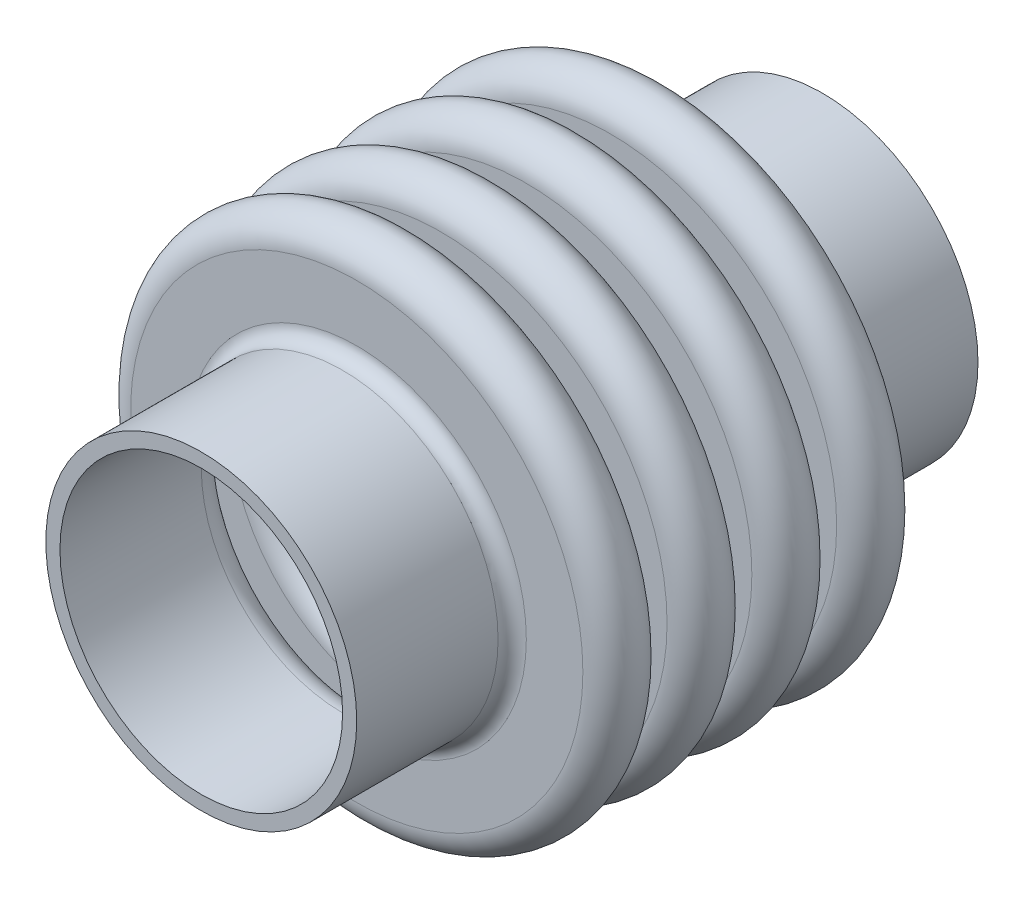
ISO-10303-21;
HEADER;
FILE_DESCRIPTION(('STEP AP214'),'2;1');
FILE_NAME('part.step','',(''),(''),'','','');
FILE_SCHEMA(('AUTOMOTIVE_DESIGN { 1 0 10303 214 1 1 1 1 }'));
ENDSEC;
DATA;
#1=APPLICATION_CONTEXT('core data for automotive mechanical design processes');
#2=APPLICATION_PROTOCOL_DEFINITION('international standard','automotive_design',2000,#1);
#3=PRODUCT_CONTEXT('',#1,'mechanical');
#4=PRODUCT('Part','Part','',(#3));
#5=PRODUCT_RELATED_PRODUCT_CATEGORY('part','',(#4));
#6=PRODUCT_DEFINITION_FORMATION('','',#4);
#7=PRODUCT_DEFINITION_CONTEXT('part definition',#1,'design');
#8=PRODUCT_DEFINITION('design','',#6,#7);
#9=PRODUCT_DEFINITION_SHAPE('','',#8);
#10=(LENGTH_UNIT() NAMED_UNIT(*) SI_UNIT(.MILLI.,.METRE.));
#11=(NAMED_UNIT(*) PLANE_ANGLE_UNIT() SI_UNIT($,.RADIAN.));
#12=(NAMED_UNIT(*) SI_UNIT($,.STERADIAN.) SOLID_ANGLE_UNIT());
#13=UNCERTAINTY_MEASURE_WITH_UNIT(LENGTH_MEASURE(1.E-05),#10,'distance_accuracy_value','');
#14=(GEOMETRIC_REPRESENTATION_CONTEXT(3) GLOBAL_UNCERTAINTY_ASSIGNED_CONTEXT((#13)) GLOBAL_UNIT_ASSIGNED_CONTEXT((#10,
#11,#12)) REPRESENTATION_CONTEXT('',''));
#15=CARTESIAN_POINT('',(0.,0.,0.));
#16=DIRECTION('',(0.,0.,1.));
#17=DIRECTION('',(1.,0.,0.));
#18=AXIS2_PLACEMENT_3D('',#15,#16,#17);
#19=CARTESIAN_POINT('',(0.,27.94,43.18));
#20=DIRECTION('',(0.,0.,-1.));
#21=DIRECTION('',(-1.,0.,0.));
#22=AXIS2_PLACEMENT_3D('',#19,#20,#21);
#23=PLANE('',#22);
#24=CARTESIAN_POINT('',(0.,0.,43.18));
#25=DIRECTION('',(0.,0.,1.));
#26=DIRECTION('',(1.,0.,0.));
#27=AXIS2_PLACEMENT_3D('',#24,#25,#26);
#28=CIRCLE('',#27,25.4);
#29=CARTESIAN_POINT('',(25.4,0.,43.18));
#30=VERTEX_POINT('',#29);
#31=EDGE_CURVE('E10',#30,#30,#28,.T.);
#32=ORIENTED_EDGE('',*,*,#31,.F.);
#33=EDGE_LOOP('',(#32));
#34=FACE_BOUND('',#33,.T.);
#35=CARTESIAN_POINT('',(0.,0.,43.18));
#36=DIRECTION('',(0.,0.,1.));
#37=DIRECTION('',(1.,0.,0.));
#38=AXIS2_PLACEMENT_3D('',#35,#36,#37);
#39=CIRCLE('',#38,27.94);
#40=CARTESIAN_POINT('',(27.94,0.,43.18));
#41=VERTEX_POINT('',#40);
#42=EDGE_CURVE('E156',#41,#41,#39,.T.);
#43=ORIENTED_EDGE('',*,*,#42,.T.);
#44=EDGE_LOOP('',(#43));
#45=FACE_BOUND('',#44,.T.);
#46=ADVANCED_FACE('F32',(#34,#45),#23,.F.);
#47=CARTESIAN_POINT('',(0.,0.,39.0149144384826));
#48=DIRECTION('',(0.,0.,1.));
#49=DIRECTION('',(1.,0.,0.));
#50=AXIS2_PLACEMENT_3D('',#47,#48,#49);
#51=CYLINDRICAL_SURFACE('',#50,25.4);
#52=CARTESIAN_POINT('',(0.,0.,17.78));
#53=DIRECTION('',(0.,0.,1.));
#54=DIRECTION('',(1.,0.,0.));
#55=AXIS2_PLACEMENT_3D('',#52,#53,#54);
#56=CIRCLE('',#55,25.4);
#57=CARTESIAN_POINT('',(25.4,0.,17.78));
#58=VERTEX_POINT('',#57);
#59=EDGE_CURVE('E38',#58,#58,#56,.T.);
#60=ORIENTED_EDGE('',*,*,#59,.F.);
#61=EDGE_LOOP('',(#60));
#62=FACE_BOUND('',#61,.T.);
#63=ORIENTED_EDGE('',*,*,#31,.T.);
#64=EDGE_LOOP('',(#63));
#65=FACE_BOUND('',#64,.T.);
#66=ADVANCED_FACE('F385',(#62,#65),#51,.F.);
#67=CARTESIAN_POINT('',(0.,0.,17.78));
#68=DIRECTION('',(0.,0.,1.));
#69=DIRECTION('',(1.,0.,0.));
#70=AXIS2_PLACEMENT_3D('',#67,#68,#69);
#71=TOROIDAL_SURFACE('',#70,30.48,5.08);
#72=CARTESIAN_POINT('',(0.,0.,12.7));
#73=DIRECTION('',(0.,0.,1.));
#74=DIRECTION('',(1.,0.,0.));
#75=AXIS2_PLACEMENT_3D('',#72,#73,#74);
#76=CIRCLE('',#75,30.48);
#77=CARTESIAN_POINT('',(30.48,0.,12.7));
#78=VERTEX_POINT('',#77);
#79=EDGE_CURVE('E42',#78,#78,#76,.T.);
#80=ORIENTED_EDGE('',*,*,#79,.F.);
#81=EDGE_LOOP('',(#80));
#82=FACE_BOUND('',#81,.T.);
#83=ORIENTED_EDGE('',*,*,#59,.T.);
#84=EDGE_LOOP('',(#83));
#85=FACE_BOUND('',#84,.T.);
#86=ADVANCED_FACE('F380',(#82,#85),#71,.T.);
#87=CARTESIAN_POINT('',(0.,30.48,12.7));
#88=DIRECTION('',(0.,0.,1.));
#89=DIRECTION('',(1.,0.,0.));
#90=AXIS2_PLACEMENT_3D('',#87,#88,#89);
#91=PLANE('',#90);
#92=CARTESIAN_POINT('',(0.,0.,12.7));
#93=DIRECTION('',(0.,0.,1.));
#94=DIRECTION('',(1.,0.,0.));
#95=AXIS2_PLACEMENT_3D('',#92,#93,#94);
#96=CIRCLE('',#95,40.64);
#97=CARTESIAN_POINT('',(40.64,0.,12.7));
#98=VERTEX_POINT('',#97);
#99=EDGE_CURVE('E46',#98,#98,#96,.T.);
#100=ORIENTED_EDGE('',*,*,#99,.F.);
#101=EDGE_LOOP('',(#100));
#102=FACE_BOUND('',#101,.T.);
#103=ORIENTED_EDGE('',*,*,#79,.T.);
#104=EDGE_LOOP('',(#103));
#105=FACE_BOUND('',#104,.T.);
#106=ADVANCED_FACE('F374',(#102,#105),#91,.F.);
#107=CARTESIAN_POINT('',(0.,0.,10.16));
#108=DIRECTION('',(0.,0.,1.));
#109=DIRECTION('',(1.,0.,0.));
#110=AXIS2_PLACEMENT_3D('',#107,#108,#109);
#111=TOROIDAL_SURFACE('',#110,40.64,2.54);
#112=CARTESIAN_POINT('',(0.,0.,7.61999999999999));
#113=DIRECTION('',(0.,0.,1.));
#114=DIRECTION('',(1.,0.,0.));
#115=AXIS2_PLACEMENT_3D('',#112,#113,#114);
#116=CIRCLE('',#115,40.64);
#117=CARTESIAN_POINT('',(40.64,0.,7.61999999999999));
#118=VERTEX_POINT('',#117);
#119=EDGE_CURVE('E51',#118,#118,#116,.T.);
#120=ORIENTED_EDGE('',*,*,#119,.F.);
#121=EDGE_LOOP('',(#120));
#122=FACE_BOUND('',#121,.T.);
#123=ORIENTED_EDGE('',*,*,#99,.T.);
#124=EDGE_LOOP('',(#123));
#125=FACE_BOUND('',#124,.T.);
#126=ADVANCED_FACE('F368',(#122,#125),#111,.F.);
#127=CARTESIAN_POINT('',(0.,40.64,7.61999999999999));
#128=DIRECTION('',(0.,0.,-1.));
#129=DIRECTION('',(-1.,0.,0.));
#130=AXIS2_PLACEMENT_3D('',#127,#128,#129);
#131=PLANE('',#130);
#132=CARTESIAN_POINT('',(0.,0.,7.61999999999999));
#133=DIRECTION('',(0.,0.,1.));
#134=DIRECTION('',(1.,0.,0.));
#135=AXIS2_PLACEMENT_3D('',#132,#133,#134);
#136=CIRCLE('',#135,30.48);
#137=CARTESIAN_POINT('',(30.48,0.,7.61999999999999));
#138=VERTEX_POINT('',#137);
#139=EDGE_CURVE('E54',#138,#138,#136,.T.);
#140=ORIENTED_EDGE('',*,*,#139,.F.);
#141=EDGE_LOOP('',(#140));
#142=FACE_BOUND('',#141,.T.);
#143=ORIENTED_EDGE('',*,*,#119,.T.);
#144=EDGE_LOOP('',(#143));
#145=FACE_BOUND('',#144,.T.);
#146=ADVANCED_FACE('F362',(#142,#145),#131,.F.);
#147=CARTESIAN_POINT('',(0.,0.,2.59448822453713));
#148=DIRECTION('',(0.,0.,1.));
#149=DIRECTION('',(1.,0.,0.));
#150=AXIS2_PLACEMENT_3D('',#147,#148,#149);
#151=TOROIDAL_SURFACE('',#150,30.48,5.02551177546286);
#152=CARTESIAN_POINT('',(0.,0.,-2.43102355092573));
#153=DIRECTION('',(0.,0.,1.));
#154=DIRECTION('',(1.,0.,0.));
#155=AXIS2_PLACEMENT_3D('',#152,#153,#154);
#156=CIRCLE('',#155,30.48);
#157=CARTESIAN_POINT('',(30.48,0.,-2.43102355092573));
#158=VERTEX_POINT('',#157);
#159=EDGE_CURVE('E57',#158,#158,#156,.T.);
#160=ORIENTED_EDGE('',*,*,#159,.F.);
#161=EDGE_LOOP('',(#160));
#162=FACE_BOUND('',#161,.T.);
#163=ORIENTED_EDGE('',*,*,#139,.T.);
#164=EDGE_LOOP('',(#163));
#165=FACE_BOUND('',#164,.T.);
#166=ADVANCED_FACE('F356',(#162,#165),#151,.T.);
#167=CARTESIAN_POINT('',(0.,30.48,-2.43102355092573));
#168=DIRECTION('',(0.,0.,1.));
#169=DIRECTION('',(1.,0.,0.));
#170=AXIS2_PLACEMENT_3D('',#167,#168,#169);
#171=PLANE('',#170);
#172=CARTESIAN_POINT('',(0.,0.,-2.43102355092573));
#173=DIRECTION('',(0.,0.,1.));
#174=DIRECTION('',(1.,0.,0.));
#175=AXIS2_PLACEMENT_3D('',#172,#173,#174);
#176=CIRCLE('',#175,40.64);
#177=CARTESIAN_POINT('',(40.64,0.,-2.43102355092573));
#178=VERTEX_POINT('',#177);
#179=EDGE_CURVE('E60',#178,#178,#176,.T.);
#180=ORIENTED_EDGE('',*,*,#179,.F.);
#181=EDGE_LOOP('',(#180));
#182=FACE_BOUND('',#181,.T.);
#183=ORIENTED_EDGE('',*,*,#159,.T.);
#184=EDGE_LOOP('',(#183));
#185=FACE_BOUND('',#184,.T.);
#186=ADVANCED_FACE('F350',(#182,#185),#171,.F.);
#187=CARTESIAN_POINT('',(0.,0.,-4.97102355092573));
#188=DIRECTION('',(0.,0.,1.));
#189=DIRECTION('',(1.,0.,0.));
#190=AXIS2_PLACEMENT_3D('',#187,#188,#189);
#191=TOROIDAL_SURFACE('',#190,40.64,2.54);
#192=CARTESIAN_POINT('',(0.,0.,-7.51102355092573));
#193=DIRECTION('',(0.,0.,1.));
#194=DIRECTION('',(1.,0.,0.));
#195=AXIS2_PLACEMENT_3D('',#192,#193,#194);
#196=CIRCLE('',#195,40.64);
#197=CARTESIAN_POINT('',(40.64,0.,-7.51102355092573));
#198=VERTEX_POINT('',#197);
#199=EDGE_CURVE('E63',#198,#198,#196,.T.);
#200=ORIENTED_EDGE('',*,*,#199,.F.);
#201=EDGE_LOOP('',(#200));
#202=FACE_BOUND('',#201,.T.);
#203=ORIENTED_EDGE('',*,*,#179,.T.);
#204=EDGE_LOOP('',(#203));
#205=FACE_BOUND('',#204,.T.);
#206=ADVANCED_FACE('F344',(#202,#205),#191,.F.);
#207=CARTESIAN_POINT('',(0.,40.64,-7.51102355092573));
#208=DIRECTION('',(0.,0.,-1.));
#209=DIRECTION('',(-1.,0.,0.));
#210=AXIS2_PLACEMENT_3D('',#207,#208,#209);
#211=PLANE('',#210);
#212=CARTESIAN_POINT('',(0.,0.,-7.51102355092573));
#213=DIRECTION('',(0.,0.,1.));
#214=DIRECTION('',(1.,0.,0.));
#215=AXIS2_PLACEMENT_3D('',#212,#213,#214);
#216=CIRCLE('',#215,30.48);
#217=CARTESIAN_POINT('',(30.48,0.,-7.51102355092573));
#218=VERTEX_POINT('',#217);
#219=EDGE_CURVE('E66',#218,#218,#216,.T.);
#220=ORIENTED_EDGE('',*,*,#219,.F.);
#221=EDGE_LOOP('',(#220));
#222=FACE_BOUND('',#221,.T.);
#223=ORIENTED_EDGE('',*,*,#199,.T.);
#224=EDGE_LOOP('',(#223));
#225=FACE_BOUND('',#224,.T.);
#226=ADVANCED_FACE('F338',(#222,#225),#211,.F.);
#227=CARTESIAN_POINT('',(0.,0.,-12.5910235509257));
#228=DIRECTION('',(0.,0.,1.));
#229=DIRECTION('',(1.,0.,0.));
#230=AXIS2_PLACEMENT_3D('',#227,#228,#229);
#231=TOROIDAL_SURFACE('',#230,30.48,5.08);
#232=CARTESIAN_POINT('',(0.,0.,-17.6710235509257));
#233=DIRECTION('',(0.,0.,1.));
#234=DIRECTION('',(1.,0.,0.));
#235=AXIS2_PLACEMENT_3D('',#232,#233,#234);
#236=CIRCLE('',#235,30.48);
#237=CARTESIAN_POINT('',(30.48,0.,-17.6710235509257));
#238=VERTEX_POINT('',#237);
#239=EDGE_CURVE('E69',#238,#238,#236,.T.);
#240=ORIENTED_EDGE('',*,*,#239,.F.);
#241=EDGE_LOOP('',(#240));
#242=FACE_BOUND('',#241,.T.);
#243=ORIENTED_EDGE('',*,*,#219,.T.);
#244=EDGE_LOOP('',(#243));
#245=FACE_BOUND('',#244,.T.);
#246=ADVANCED_FACE('F332',(#242,#245),#231,.T.);
#247=CARTESIAN_POINT('',(0.,30.48,-17.6710235509257));
#248=DIRECTION('',(0.,0.,1.));
#249=DIRECTION('',(1.,0.,0.));
#250=AXIS2_PLACEMENT_3D('',#247,#248,#249);
#251=PLANE('',#250);
#252=CARTESIAN_POINT('',(0.,0.,-17.6710235509257));
#253=DIRECTION('',(0.,0.,1.));
#254=DIRECTION('',(1.,0.,0.));
#255=AXIS2_PLACEMENT_3D('',#252,#253,#254);
#256=CIRCLE('',#255,40.64);
#257=CARTESIAN_POINT('',(40.64,0.,-17.6710235509257));
#258=VERTEX_POINT('',#257);
#259=EDGE_CURVE('E72',#258,#258,#256,.T.);
#260=ORIENTED_EDGE('',*,*,#259,.F.);
#261=EDGE_LOOP('',(#260));
#262=FACE_BOUND('',#261,.T.);
#263=ORIENTED_EDGE('',*,*,#239,.T.);
#264=EDGE_LOOP('',(#263));
#265=FACE_BOUND('',#264,.T.);
#266=ADVANCED_FACE('F326',(#262,#265),#251,.F.);
#267=CARTESIAN_POINT('',(0.,0.,-20.2110235509257));
#268=DIRECTION('',(0.,0.,1.));
#269=DIRECTION('',(1.,0.,0.));
#270=AXIS2_PLACEMENT_3D('',#267,#268,#269);
#271=TOROIDAL_SURFACE('',#270,40.64,2.54);
#272=CARTESIAN_POINT('',(0.,0.,-22.7510235509257));
#273=DIRECTION('',(0.,0.,1.));
#274=DIRECTION('',(1.,0.,0.));
#275=AXIS2_PLACEMENT_3D('',#272,#273,#274);
#276=CIRCLE('',#275,40.64);
#277=CARTESIAN_POINT('',(40.64,0.,-22.7510235509257));
#278=VERTEX_POINT('',#277);
#279=EDGE_CURVE('E75',#278,#278,#276,.T.);
#280=ORIENTED_EDGE('',*,*,#279,.F.);
#281=EDGE_LOOP('',(#280));
#282=FACE_BOUND('',#281,.T.);
#283=ORIENTED_EDGE('',*,*,#259,.T.);
#284=EDGE_LOOP('',(#283));
#285=FACE_BOUND('',#284,.T.);
#286=ADVANCED_FACE('F320',(#282,#285),#271,.F.);
#287=CARTESIAN_POINT('',(0.,40.64,-22.7510235509257));
#288=DIRECTION('',(0.,0.,-1.));
#289=DIRECTION('',(-1.,0.,0.));
#290=AXIS2_PLACEMENT_3D('',#287,#288,#289);
#291=PLANE('',#290);
#292=CARTESIAN_POINT('',(0.,0.,-22.7510235509257));
#293=DIRECTION('',(0.,0.,1.));
#294=DIRECTION('',(1.,0.,0.));
#295=AXIS2_PLACEMENT_3D('',#292,#293,#294);
#296=CIRCLE('',#295,30.48);
#297=CARTESIAN_POINT('',(30.48,0.,-22.7510235509257));
#298=VERTEX_POINT('',#297);
#299=EDGE_CURVE('E78',#298,#298,#296,.T.);
#300=ORIENTED_EDGE('',*,*,#299,.F.);
#301=EDGE_LOOP('',(#300));
#302=FACE_BOUND('',#301,.T.);
#303=ORIENTED_EDGE('',*,*,#279,.T.);
#304=EDGE_LOOP('',(#303));
#305=FACE_BOUND('',#304,.T.);
#306=ADVANCED_FACE('F314',(#302,#305),#291,.F.);
#307=CARTESIAN_POINT('',(0.,0.,-27.8310235509257));
#308=DIRECTION('',(0.,0.,1.));
#309=DIRECTION('',(1.,0.,0.));
#310=AXIS2_PLACEMENT_3D('',#307,#308,#309);
#311=TOROIDAL_SURFACE('',#310,30.48,5.08);
#312=CARTESIAN_POINT('',(0.,0.,-32.9110235509257));
#313=DIRECTION('',(0.,0.,1.));
#314=DIRECTION('',(1.,0.,0.));
#315=AXIS2_PLACEMENT_3D('',#312,#313,#314);
#316=CIRCLE('',#315,30.48);
#317=CARTESIAN_POINT('',(30.48,0.,-32.9110235509257));
#318=VERTEX_POINT('',#317);
#319=EDGE_CURVE('E81',#318,#318,#316,.T.);
#320=ORIENTED_EDGE('',*,*,#319,.F.);
#321=EDGE_LOOP('',(#320));
#322=FACE_BOUND('',#321,.T.);
#323=ORIENTED_EDGE('',*,*,#299,.T.);
#324=EDGE_LOOP('',(#323));
#325=FACE_BOUND('',#324,.T.);
#326=ADVANCED_FACE('F308',(#322,#325),#311,.T.);
#327=CARTESIAN_POINT('',(0.,30.48,-32.9110235509257));
#328=DIRECTION('',(0.,0.,1.));
#329=DIRECTION('',(1.,0.,0.));
#330=AXIS2_PLACEMENT_3D('',#327,#328,#329);
#331=PLANE('',#330);
#332=CARTESIAN_POINT('',(0.,0.,-32.9110235509257));
#333=DIRECTION('',(0.,0.,1.));
#334=DIRECTION('',(1.,0.,0.));
#335=AXIS2_PLACEMENT_3D('',#332,#333,#334);
#336=CIRCLE('',#335,40.64);
#337=CARTESIAN_POINT('',(40.64,0.,-32.9110235509257));
#338=VERTEX_POINT('',#337);
#339=EDGE_CURVE('E84',#338,#338,#336,.T.);
#340=ORIENTED_EDGE('',*,*,#339,.F.);
#341=EDGE_LOOP('',(#340));
#342=FACE_BOUND('',#341,.T.);
#343=ORIENTED_EDGE('',*,*,#319,.T.);
#344=EDGE_LOOP('',(#343));
#345=FACE_BOUND('',#344,.T.);
#346=ADVANCED_FACE('F302',(#342,#345),#331,.F.);
#347=CARTESIAN_POINT('',(0.,0.,-35.4510235509257));
#348=DIRECTION('',(0.,0.,1.));
#349=DIRECTION('',(1.,0.,0.));
#350=AXIS2_PLACEMENT_3D('',#347,#348,#349);
#351=TOROIDAL_SURFACE('',#350,40.64,2.54);
#352=CARTESIAN_POINT('',(0.,0.,-37.9910235509257));
#353=DIRECTION('',(0.,0.,1.));
#354=DIRECTION('',(1.,0.,0.));
#355=AXIS2_PLACEMENT_3D('',#352,#353,#354);
#356=CIRCLE('',#355,40.64);
#357=CARTESIAN_POINT('',(40.64,0.,-37.9910235509257));
#358=VERTEX_POINT('',#357);
#359=EDGE_CURVE('E87',#358,#358,#356,.T.);
#360=ORIENTED_EDGE('',*,*,#359,.F.);
#361=EDGE_LOOP('',(#360));
#362=FACE_BOUND('',#361,.T.);
#363=ORIENTED_EDGE('',*,*,#339,.T.);
#364=EDGE_LOOP('',(#363));
#365=FACE_BOUND('',#364,.T.);
#366=ADVANCED_FACE('F296',(#362,#365),#351,.F.);
#367=CARTESIAN_POINT('',(0.,40.64,-37.9910235509257));
#368=DIRECTION('',(0.,0.,-1.));
#369=DIRECTION('',(-1.,0.,0.));
#370=AXIS2_PLACEMENT_3D('',#367,#368,#369);
#371=PLANE('',#370);
#372=CARTESIAN_POINT('',(0.,0.,-37.9910235509257));
#373=DIRECTION('',(0.,0.,1.));
#374=DIRECTION('',(1.,0.,0.));
#375=AXIS2_PLACEMENT_3D('',#372,#373,#374);
#376=CIRCLE('',#375,30.48);
#377=CARTESIAN_POINT('',(30.48,0.,-37.9910235509257));
#378=VERTEX_POINT('',#377);
#379=EDGE_CURVE('E90',#378,#378,#376,.T.);
#380=ORIENTED_EDGE('',*,*,#379,.F.);
#381=EDGE_LOOP('',(#380));
#382=FACE_BOUND('',#381,.T.);
#383=ORIENTED_EDGE('',*,*,#359,.T.);
#384=EDGE_LOOP('',(#383));
#385=FACE_BOUND('',#384,.T.);
#386=ADVANCED_FACE('F290',(#382,#385),#371,.F.);
#387=CARTESIAN_POINT('',(0.,0.,-43.0710235509257));
#388=DIRECTION('',(0.,0.,1.));
#389=DIRECTION('',(1.,0.,0.));
#390=AXIS2_PLACEMENT_3D('',#387,#388,#389);
#391=TOROIDAL_SURFACE('',#390,30.48,5.08);
#392=CARTESIAN_POINT('',(0.,0.,-43.0710235509258));
#393=DIRECTION('',(0.,0.,1.));
#394=DIRECTION('',(1.,0.,0.));
#395=AXIS2_PLACEMENT_3D('',#392,#393,#394);
#396=CIRCLE('',#395,25.4);
#397=CARTESIAN_POINT('',(25.4,0.,-43.0710235509258));
#398=VERTEX_POINT('',#397);
#399=EDGE_CURVE('E93',#398,#398,#396,.T.);
#400=ORIENTED_EDGE('',*,*,#399,.F.);
#401=EDGE_LOOP('',(#400));
#402=FACE_BOUND('',#401,.T.);
#403=ORIENTED_EDGE('',*,*,#379,.T.);
#404=EDGE_LOOP('',(#403));
#405=FACE_BOUND('',#404,.T.);
#406=ADVANCED_FACE('F284',(#402,#405),#391,.T.);
#407=CARTESIAN_POINT('',(0.,0.,39.0149144384826));
#408=DIRECTION('',(0.,0.,1.));
#409=DIRECTION('',(1.,0.,0.));
#410=AXIS2_PLACEMENT_3D('',#407,#408,#409);
#411=CYLINDRICAL_SURFACE('',#410,25.4);
#412=CARTESIAN_POINT('',(0.,0.,-68.4710235509257));
#413=DIRECTION('',(0.,0.,1.));
#414=DIRECTION('',(1.,0.,0.));
#415=AXIS2_PLACEMENT_3D('',#412,#413,#414);
#416=CIRCLE('',#415,25.4);
#417=CARTESIAN_POINT('',(25.4,0.,-68.4710235509257));
#418=VERTEX_POINT('',#417);
#419=EDGE_CURVE('E96',#418,#418,#416,.T.);
#420=ORIENTED_EDGE('',*,*,#419,.F.);
#421=EDGE_LOOP('',(#420));
#422=FACE_BOUND('',#421,.T.);
#423=ORIENTED_EDGE('',*,*,#399,.T.);
#424=EDGE_LOOP('',(#423));
#425=FACE_BOUND('',#424,.T.);
#426=ADVANCED_FACE('F278',(#422,#425),#411,.F.);
#427=CARTESIAN_POINT('',(0.,27.94,-68.4710235509257));
#428=DIRECTION('',(0.,0.,1.));
#429=DIRECTION('',(1.,0.,0.));
#430=AXIS2_PLACEMENT_3D('',#427,#428,#429);
#431=PLANE('',#430);
#432=CARTESIAN_POINT('',(0.,0.,-68.4710235509257));
#433=DIRECTION('',(0.,0.,1.));
#434=DIRECTION('',(1.,0.,0.));
#435=AXIS2_PLACEMENT_3D('',#432,#433,#434);
#436=CIRCLE('',#435,27.94);
#437=CARTESIAN_POINT('',(27.94,0.,-68.4710235509257));
#438=VERTEX_POINT('',#437);
#439=EDGE_CURVE('E99',#438,#438,#436,.T.);
#440=ORIENTED_EDGE('',*,*,#439,.F.);
#441=EDGE_LOOP('',(#440));
#442=FACE_BOUND('',#441,.T.);
#443=ORIENTED_EDGE('',*,*,#419,.T.);
#444=EDGE_LOOP('',(#443));
#445=FACE_BOUND('',#444,.T.);
#446=ADVANCED_FACE('F272',(#442,#445),#431,.F.);
#447=CARTESIAN_POINT('',(0.,0.,39.0149144384826));
#448=DIRECTION('',(0.,0.,1.));
#449=DIRECTION('',(1.,0.,0.));
#450=AXIS2_PLACEMENT_3D('',#447,#448,#449);
#451=CYLINDRICAL_SURFACE('',#450,27.94);
#452=CARTESIAN_POINT('',(0.,0.,-43.0710235509258));
#453=DIRECTION('',(0.,0.,1.));
#454=DIRECTION('',(1.,0.,0.));
#455=AXIS2_PLACEMENT_3D('',#452,#453,#454);
#456=CIRCLE('',#455,27.94);
#457=CARTESIAN_POINT('',(27.94,0.,-43.0710235509258));
#458=VERTEX_POINT('',#457);
#459=EDGE_CURVE('E102',#458,#458,#456,.T.);
#460=ORIENTED_EDGE('',*,*,#459,.F.);
#461=EDGE_LOOP('',(#460));
#462=FACE_BOUND('',#461,.T.);
#463=ORIENTED_EDGE('',*,*,#439,.T.);
#464=EDGE_LOOP('',(#463));
#465=FACE_BOUND('',#464,.T.);
#466=ADVANCED_FACE('F266',(#462,#465),#451,.T.);
#467=CARTESIAN_POINT('',(0.,0.,-43.0710235509257));
#468=DIRECTION('',(0.,0.,1.));
#469=DIRECTION('',(1.,0.,0.));
#470=AXIS2_PLACEMENT_3D('',#467,#468,#469);
#471=TOROIDAL_SURFACE('',#470,30.48,2.54);
#472=CARTESIAN_POINT('',(0.,0.,-40.5310235509257));
#473=DIRECTION('',(0.,0.,1.));
#474=DIRECTION('',(1.,0.,0.));
#475=AXIS2_PLACEMENT_3D('',#472,#473,#474);
#476=CIRCLE('',#475,30.48);
#477=CARTESIAN_POINT('',(30.48,0.,-40.5310235509257));
#478=VERTEX_POINT('',#477);
#479=EDGE_CURVE('E105',#478,#478,#476,.T.);
#480=ORIENTED_EDGE('',*,*,#479,.F.);
#481=EDGE_LOOP('',(#480));
#482=FACE_BOUND('',#481,.T.);
#483=ORIENTED_EDGE('',*,*,#459,.T.);
#484=EDGE_LOOP('',(#483));
#485=FACE_BOUND('',#484,.T.);
#486=ADVANCED_FACE('F260',(#482,#485),#471,.F.);
#487=CARTESIAN_POINT('',(0.,40.64,-40.5310235509257));
#488=DIRECTION('',(0.,0.,1.));
#489=DIRECTION('',(1.,0.,0.));
#490=AXIS2_PLACEMENT_3D('',#487,#488,#489);
#491=PLANE('',#490);
#492=CARTESIAN_POINT('',(0.,0.,-40.5310235509257));
#493=DIRECTION('',(0.,0.,1.));
#494=DIRECTION('',(1.,0.,0.));
#495=AXIS2_PLACEMENT_3D('',#492,#493,#494);
#496=CIRCLE('',#495,40.64);
#497=CARTESIAN_POINT('',(40.64,0.,-40.5310235509257));
#498=VERTEX_POINT('',#497);
#499=EDGE_CURVE('E108',#498,#498,#496,.T.);
#500=ORIENTED_EDGE('',*,*,#499,.F.);
#501=EDGE_LOOP('',(#500));
#502=FACE_BOUND('',#501,.T.);
#503=ORIENTED_EDGE('',*,*,#479,.T.);
#504=EDGE_LOOP('',(#503));
#505=FACE_BOUND('',#504,.T.);
#506=ADVANCED_FACE('F254',(#502,#505),#491,.F.);
#507=CARTESIAN_POINT('',(0.,0.,-35.4510235509257));
#508=DIRECTION('',(0.,0.,1.));
#509=DIRECTION('',(1.,0.,0.));
#510=AXIS2_PLACEMENT_3D('',#507,#508,#509);
#511=TOROIDAL_SURFACE('',#510,40.64,5.08);
#512=CARTESIAN_POINT('',(0.,0.,-30.3710235509257));
#513=DIRECTION('',(0.,0.,1.));
#514=DIRECTION('',(1.,0.,0.));
#515=AXIS2_PLACEMENT_3D('',#512,#513,#514);
#516=CIRCLE('',#515,40.64);
#517=CARTESIAN_POINT('',(40.64,0.,-30.3710235509257));
#518=VERTEX_POINT('',#517);
#519=EDGE_CURVE('E111',#518,#518,#516,.T.);
#520=ORIENTED_EDGE('',*,*,#519,.F.);
#521=EDGE_LOOP('',(#520));
#522=FACE_BOUND('',#521,.T.);
#523=ORIENTED_EDGE('',*,*,#499,.T.);
#524=EDGE_LOOP('',(#523));
#525=FACE_BOUND('',#524,.T.);
#526=ADVANCED_FACE('F248',(#522,#525),#511,.T.);
#527=CARTESIAN_POINT('',(0.,30.48,-30.3710235509257));
#528=DIRECTION('',(0.,0.,-1.));
#529=DIRECTION('',(-1.,0.,0.));
#530=AXIS2_PLACEMENT_3D('',#527,#528,#529);
#531=PLANE('',#530);
#532=CARTESIAN_POINT('',(0.,0.,-30.3710235509257));
#533=DIRECTION('',(0.,0.,1.));
#534=DIRECTION('',(1.,0.,0.));
#535=AXIS2_PLACEMENT_3D('',#532,#533,#534);
#536=CIRCLE('',#535,30.48);
#537=CARTESIAN_POINT('',(30.48,0.,-30.3710235509257));
#538=VERTEX_POINT('',#537);
#539=EDGE_CURVE('E114',#538,#538,#536,.T.);
#540=ORIENTED_EDGE('',*,*,#539,.F.);
#541=EDGE_LOOP('',(#540));
#542=FACE_BOUND('',#541,.T.);
#543=ORIENTED_EDGE('',*,*,#519,.T.);
#544=EDGE_LOOP('',(#543));
#545=FACE_BOUND('',#544,.T.);
#546=ADVANCED_FACE('F242',(#542,#545),#531,.F.);
#547=CARTESIAN_POINT('',(0.,0.,-27.8310235509257));
#548=DIRECTION('',(0.,0.,1.));
#549=DIRECTION('',(1.,0.,0.));
#550=AXIS2_PLACEMENT_3D('',#547,#548,#549);
#551=TOROIDAL_SURFACE('',#550,30.48,2.54);
#552=CARTESIAN_POINT('',(0.,0.,-25.2910235509257));
#553=DIRECTION('',(0.,0.,1.));
#554=DIRECTION('',(1.,0.,0.));
#555=AXIS2_PLACEMENT_3D('',#552,#553,#554);
#556=CIRCLE('',#555,30.48);
#557=CARTESIAN_POINT('',(30.48,0.,-25.2910235509257));
#558=VERTEX_POINT('',#557);
#559=EDGE_CURVE('E117',#558,#558,#556,.T.);
#560=ORIENTED_EDGE('',*,*,#559,.F.);
#561=EDGE_LOOP('',(#560));
#562=FACE_BOUND('',#561,.T.);
#563=ORIENTED_EDGE('',*,*,#539,.T.);
#564=EDGE_LOOP('',(#563));
#565=FACE_BOUND('',#564,.T.);
#566=ADVANCED_FACE('F236',(#562,#565),#551,.F.);
#567=CARTESIAN_POINT('',(0.,40.64,-25.2910235509257));
#568=DIRECTION('',(0.,0.,1.));
#569=DIRECTION('',(1.,0.,0.));
#570=AXIS2_PLACEMENT_3D('',#567,#568,#569);
#571=PLANE('',#570);
#572=CARTESIAN_POINT('',(0.,0.,-25.2910235509257));
#573=DIRECTION('',(0.,0.,1.));
#574=DIRECTION('',(1.,0.,0.));
#575=AXIS2_PLACEMENT_3D('',#572,#573,#574);
#576=CIRCLE('',#575,40.64);
#577=CARTESIAN_POINT('',(40.64,0.,-25.2910235509257));
#578=VERTEX_POINT('',#577);
#579=EDGE_CURVE('E120',#578,#578,#576,.T.);
#580=ORIENTED_EDGE('',*,*,#579,.F.);
#581=EDGE_LOOP('',(#580));
#582=FACE_BOUND('',#581,.T.);
#583=ORIENTED_EDGE('',*,*,#559,.T.);
#584=EDGE_LOOP('',(#583));
#585=FACE_BOUND('',#584,.T.);
#586=ADVANCED_FACE('F230',(#582,#585),#571,.F.);
#587=CARTESIAN_POINT('',(0.,0.,-20.2110235509257));
#588=DIRECTION('',(0.,0.,1.));
#589=DIRECTION('',(1.,0.,0.));
#590=AXIS2_PLACEMENT_3D('',#587,#588,#589);
#591=TOROIDAL_SURFACE('',#590,40.64,5.08);
#592=CARTESIAN_POINT('',(0.,0.,-15.1310235509257));
#593=DIRECTION('',(0.,0.,1.));
#594=DIRECTION('',(1.,0.,0.));
#595=AXIS2_PLACEMENT_3D('',#592,#593,#594);
#596=CIRCLE('',#595,40.64);
#597=CARTESIAN_POINT('',(40.64,0.,-15.1310235509257));
#598=VERTEX_POINT('',#597);
#599=EDGE_CURVE('E123',#598,#598,#596,.T.);
#600=ORIENTED_EDGE('',*,*,#599,.F.);
#601=EDGE_LOOP('',(#600));
#602=FACE_BOUND('',#601,.T.);
#603=ORIENTED_EDGE('',*,*,#579,.T.);
#604=EDGE_LOOP('',(#603));
#605=FACE_BOUND('',#604,.T.);
#606=ADVANCED_FACE('F224',(#602,#605),#591,.T.);
#607=CARTESIAN_POINT('',(0.,30.48,-15.1310235509257));
#608=DIRECTION('',(0.,0.,-1.));
#609=DIRECTION('',(-1.,0.,0.));
#610=AXIS2_PLACEMENT_3D('',#607,#608,#609);
#611=PLANE('',#610);
#612=CARTESIAN_POINT('',(0.,0.,-15.1310235509257));
#613=DIRECTION('',(0.,0.,1.));
#614=DIRECTION('',(1.,0.,0.));
#615=AXIS2_PLACEMENT_3D('',#612,#613,#614);
#616=CIRCLE('',#615,30.48);
#617=CARTESIAN_POINT('',(30.48,0.,-15.1310235509257));
#618=VERTEX_POINT('',#617);
#619=EDGE_CURVE('E126',#618,#618,#616,.T.);
#620=ORIENTED_EDGE('',*,*,#619,.F.);
#621=EDGE_LOOP('',(#620));
#622=FACE_BOUND('',#621,.T.);
#623=ORIENTED_EDGE('',*,*,#599,.T.);
#624=EDGE_LOOP('',(#623));
#625=FACE_BOUND('',#624,.T.);
#626=ADVANCED_FACE('F218',(#622,#625),#611,.F.);
#627=CARTESIAN_POINT('',(0.,0.,-12.5910235509257));
#628=DIRECTION('',(0.,0.,1.));
#629=DIRECTION('',(1.,0.,0.));
#630=AXIS2_PLACEMENT_3D('',#627,#628,#629);
#631=TOROIDAL_SURFACE('',#630,30.48,2.54);
#632=CARTESIAN_POINT('',(0.,0.,-10.0510235509257));
#633=DIRECTION('',(0.,0.,1.));
#634=DIRECTION('',(1.,0.,0.));
#635=AXIS2_PLACEMENT_3D('',#632,#633,#634);
#636=CIRCLE('',#635,30.48);
#637=CARTESIAN_POINT('',(30.48,0.,-10.0510235509257));
#638=VERTEX_POINT('',#637);
#639=EDGE_CURVE('E129',#638,#638,#636,.T.);
#640=ORIENTED_EDGE('',*,*,#639,.F.);
#641=EDGE_LOOP('',(#640));
#642=FACE_BOUND('',#641,.T.);
#643=ORIENTED_EDGE('',*,*,#619,.T.);
#644=EDGE_LOOP('',(#643));
#645=FACE_BOUND('',#644,.T.);
#646=ADVANCED_FACE('F212',(#642,#645),#631,.F.);
#647=CARTESIAN_POINT('',(0.,40.64,-10.0510235509257));
#648=DIRECTION('',(0.,0.,1.));
#649=DIRECTION('',(1.,0.,0.));
#650=AXIS2_PLACEMENT_3D('',#647,#648,#649);
#651=PLANE('',#650);
#652=CARTESIAN_POINT('',(0.,0.,-10.0510235509257));
#653=DIRECTION('',(0.,0.,1.));
#654=DIRECTION('',(1.,0.,0.));
#655=AXIS2_PLACEMENT_3D('',#652,#653,#654);
#656=CIRCLE('',#655,40.64);
#657=CARTESIAN_POINT('',(40.64,0.,-10.0510235509257));
#658=VERTEX_POINT('',#657);
#659=EDGE_CURVE('E132',#658,#658,#656,.T.);
#660=ORIENTED_EDGE('',*,*,#659,.F.);
#661=EDGE_LOOP('',(#660));
#662=FACE_BOUND('',#661,.T.);
#663=ORIENTED_EDGE('',*,*,#639,.T.);
#664=EDGE_LOOP('',(#663));
#665=FACE_BOUND('',#664,.T.);
#666=ADVANCED_FACE('F206',(#662,#665),#651,.F.);
#667=CARTESIAN_POINT('',(0.,0.,-4.97102355092573));
#668=DIRECTION('',(0.,0.,1.));
#669=DIRECTION('',(1.,0.,0.));
#670=AXIS2_PLACEMENT_3D('',#667,#668,#669);
#671=TOROIDAL_SURFACE('',#670,40.64,5.08);
#672=CARTESIAN_POINT('',(0.,0.,0.108976449074268));
#673=DIRECTION('',(0.,0.,1.));
#674=DIRECTION('',(1.,0.,0.));
#675=AXIS2_PLACEMENT_3D('',#672,#673,#674);
#676=CIRCLE('',#675,40.64);
#677=CARTESIAN_POINT('',(40.64,0.,0.108976449074268));
#678=VERTEX_POINT('',#677);
#679=EDGE_CURVE('E135',#678,#678,#676,.T.);
#680=ORIENTED_EDGE('',*,*,#679,.F.);
#681=EDGE_LOOP('',(#680));
#682=FACE_BOUND('',#681,.T.);
#683=ORIENTED_EDGE('',*,*,#659,.T.);
#684=EDGE_LOOP('',(#683));
#685=FACE_BOUND('',#684,.T.);
#686=ADVANCED_FACE('F200',(#682,#685),#671,.T.);
#687=CARTESIAN_POINT('',(0.,30.48,0.108976449074269));
#688=DIRECTION('',(0.,0.,-1.));
#689=DIRECTION('',(-1.,0.,0.));
#690=AXIS2_PLACEMENT_3D('',#687,#688,#689);
#691=PLANE('',#690);
#692=CARTESIAN_POINT('',(0.,0.,0.108976449074268));
#693=DIRECTION('',(0.,0.,1.));
#694=DIRECTION('',(1.,0.,0.));
#695=AXIS2_PLACEMENT_3D('',#692,#693,#694);
#696=CIRCLE('',#695,30.48);
#697=CARTESIAN_POINT('',(30.48,0.,0.108976449074268));
#698=VERTEX_POINT('',#697);
#699=EDGE_CURVE('E138',#698,#698,#696,.T.);
#700=ORIENTED_EDGE('',*,*,#699,.F.);
#701=EDGE_LOOP('',(#700));
#702=FACE_BOUND('',#701,.T.);
#703=ORIENTED_EDGE('',*,*,#679,.T.);
#704=EDGE_LOOP('',(#703));
#705=FACE_BOUND('',#704,.T.);
#706=ADVANCED_FACE('F194',(#702,#705),#691,.F.);
#707=CARTESIAN_POINT('',(0.,0.,2.59448822453713));
#708=DIRECTION('',(0.,0.,1.));
#709=DIRECTION('',(1.,0.,0.));
#710=AXIS2_PLACEMENT_3D('',#707,#708,#709);
#711=TOROIDAL_SURFACE('',#710,30.48,2.48551177546286);
#712=CARTESIAN_POINT('',(0.,0.,5.07999999999999));
#713=DIRECTION('',(0.,0.,1.));
#714=DIRECTION('',(1.,0.,0.));
#715=AXIS2_PLACEMENT_3D('',#712,#713,#714);
#716=CIRCLE('',#715,30.48);
#717=CARTESIAN_POINT('',(30.48,0.,5.07999999999999));
#718=VERTEX_POINT('',#717);
#719=EDGE_CURVE('E141',#718,#718,#716,.T.);
#720=ORIENTED_EDGE('',*,*,#719,.F.);
#721=EDGE_LOOP('',(#720));
#722=FACE_BOUND('',#721,.T.);
#723=ORIENTED_EDGE('',*,*,#699,.T.);
#724=EDGE_LOOP('',(#723));
#725=FACE_BOUND('',#724,.T.);
#726=ADVANCED_FACE('F188',(#722,#725),#711,.F.);
#727=CARTESIAN_POINT('',(0.,40.64,5.07999999999999));
#728=DIRECTION('',(0.,0.,1.));
#729=DIRECTION('',(1.,0.,0.));
#730=AXIS2_PLACEMENT_3D('',#727,#728,#729);
#731=PLANE('',#730);
#732=CARTESIAN_POINT('',(0.,0.,5.07999999999999));
#733=DIRECTION('',(0.,0.,1.));
#734=DIRECTION('',(1.,0.,0.));
#735=AXIS2_PLACEMENT_3D('',#732,#733,#734);
#736=CIRCLE('',#735,40.64);
#737=CARTESIAN_POINT('',(40.64,0.,5.07999999999999));
#738=VERTEX_POINT('',#737);
#739=EDGE_CURVE('E144',#738,#738,#736,.T.);
#740=ORIENTED_EDGE('',*,*,#739,.F.);
#741=EDGE_LOOP('',(#740));
#742=FACE_BOUND('',#741,.T.);
#743=ORIENTED_EDGE('',*,*,#719,.T.);
#744=EDGE_LOOP('',(#743));
#745=FACE_BOUND('',#744,.T.);
#746=ADVANCED_FACE('F182',(#742,#745),#731,.F.);
#747=CARTESIAN_POINT('',(0.,0.,10.16));
#748=DIRECTION('',(0.,0.,1.));
#749=DIRECTION('',(1.,0.,0.));
#750=AXIS2_PLACEMENT_3D('',#747,#748,#749);
#751=TOROIDAL_SURFACE('',#750,40.64,5.08);
#752=CARTESIAN_POINT('',(0.,0.,15.24));
#753=DIRECTION('',(0.,0.,1.));
#754=DIRECTION('',(1.,0.,0.));
#755=AXIS2_PLACEMENT_3D('',#752,#753,#754);
#756=CIRCLE('',#755,40.64);
#757=CARTESIAN_POINT('',(40.64,0.,15.24));
#758=VERTEX_POINT('',#757);
#759=EDGE_CURVE('E147',#758,#758,#756,.T.);
#760=ORIENTED_EDGE('',*,*,#759,.F.);
#761=EDGE_LOOP('',(#760));
#762=FACE_BOUND('',#761,.T.);
#763=ORIENTED_EDGE('',*,*,#739,.T.);
#764=EDGE_LOOP('',(#763));
#765=FACE_BOUND('',#764,.T.);
#766=ADVANCED_FACE('F176',(#762,#765),#751,.T.);
#767=CARTESIAN_POINT('',(0.,30.48,15.24));
#768=DIRECTION('',(0.,0.,-1.));
#769=DIRECTION('',(-1.,0.,0.));
#770=AXIS2_PLACEMENT_3D('',#767,#768,#769);
#771=PLANE('',#770);
#772=CARTESIAN_POINT('',(0.,0.,15.24));
#773=DIRECTION('',(0.,0.,1.));
#774=DIRECTION('',(1.,0.,0.));
#775=AXIS2_PLACEMENT_3D('',#772,#773,#774);
#776=CIRCLE('',#775,30.48);
#777=CARTESIAN_POINT('',(30.48,0.,15.24));
#778=VERTEX_POINT('',#777);
#779=EDGE_CURVE('E150',#778,#778,#776,.T.);
#780=ORIENTED_EDGE('',*,*,#779,.F.);
#781=EDGE_LOOP('',(#780));
#782=FACE_BOUND('',#781,.T.);
#783=ORIENTED_EDGE('',*,*,#759,.T.);
#784=EDGE_LOOP('',(#783));
#785=FACE_BOUND('',#784,.T.);
#786=ADVANCED_FACE('F170',(#782,#785),#771,.F.);
#787=CARTESIAN_POINT('',(0.,0.,17.78));
#788=DIRECTION('',(0.,0.,1.));
#789=DIRECTION('',(1.,0.,0.));
#790=AXIS2_PLACEMENT_3D('',#787,#788,#789);
#791=TOROIDAL_SURFACE('',#790,30.48,2.54);
#792=CARTESIAN_POINT('',(0.,0.,17.78));
#793=DIRECTION('',(0.,0.,1.));
#794=DIRECTION('',(1.,0.,0.));
#795=AXIS2_PLACEMENT_3D('',#792,#793,#794);
#796=CIRCLE('',#795,27.94);
#797=CARTESIAN_POINT('',(27.94,0.,17.78));
#798=VERTEX_POINT('',#797);
#799=EDGE_CURVE('E153',#798,#798,#796,.T.);
#800=ORIENTED_EDGE('',*,*,#799,.F.);
#801=EDGE_LOOP('',(#800));
#802=FACE_BOUND('',#801,.T.);
#803=ORIENTED_EDGE('',*,*,#779,.T.);
#804=EDGE_LOOP('',(#803));
#805=FACE_BOUND('',#804,.T.);
#806=ADVANCED_FACE('F164',(#802,#805),#791,.F.);
#807=CARTESIAN_POINT('',(0.,0.,39.0149144384826));
#808=DIRECTION('',(0.,0.,1.));
#809=DIRECTION('',(1.,0.,0.));
#810=AXIS2_PLACEMENT_3D('',#807,#808,#809);
#811=CYLINDRICAL_SURFACE('',#810,27.94);
#812=ORIENTED_EDGE('',*,*,#42,.F.);
#813=EDGE_LOOP('',(#812));
#814=FACE_BOUND('',#813,.T.);
#815=ORIENTED_EDGE('',*,*,#799,.T.);
#816=EDGE_LOOP('',(#815));
#817=FACE_BOUND('',#816,.T.);
#818=ADVANCED_FACE('F161',(#814,#817),#811,.T.);
#819=CLOSED_SHELL('',(#46,#66,#86,#106,#126,#146,#166,#186,#206,#226,#246,#266,#286,#306,#326,
#346,#366,#386,#406,#426,#446,#466,#486,#506,#526,#546,#566,#586,#606,#626,#646,#666,#686,#706,
#726,#746,#766,#786,#806,#818));
#820=MANIFOLD_SOLID_BREP('B2',#819);
#821=ADVANCED_BREP_SHAPE_REPRESENTATION('',(#18,#820),#14);
#822=SHAPE_DEFINITION_REPRESENTATION(#9,#821);
ENDSEC;
END-ISO-10303-21;
